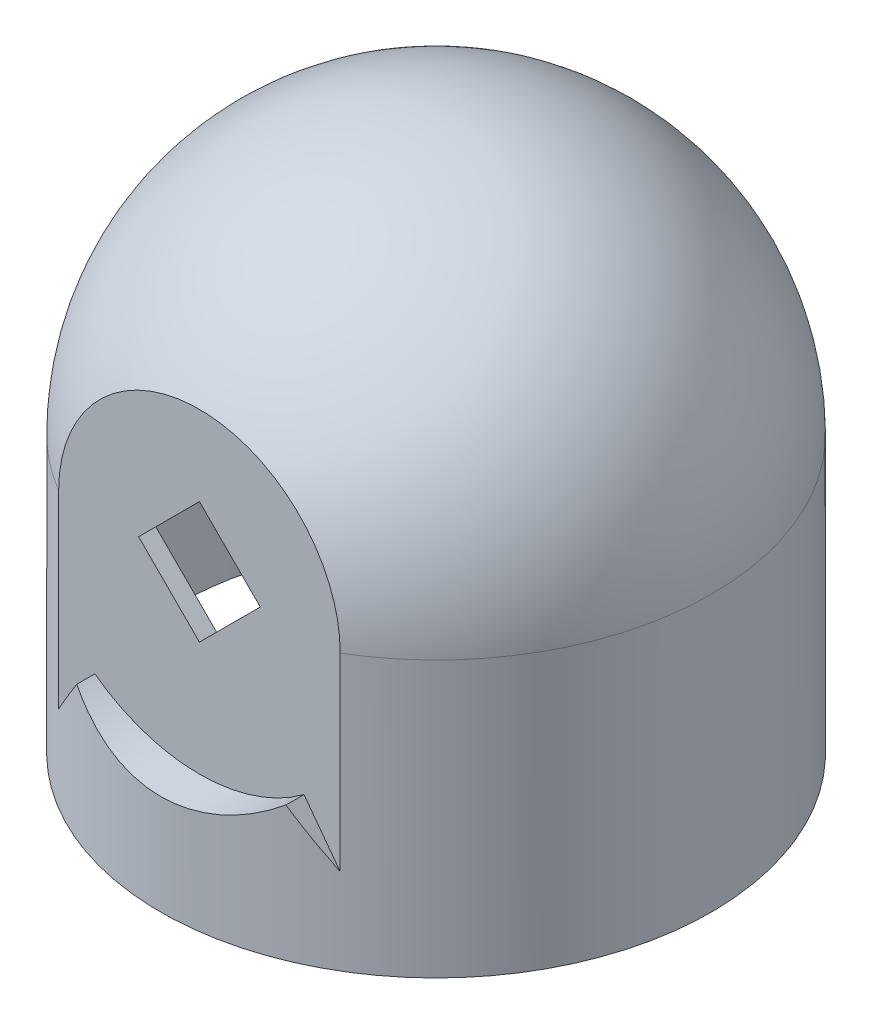
ISO-10303-21;
HEADER;
FILE_DESCRIPTION(('STEP AP214'),'2;1');
FILE_NAME('part.step','',(''),(''),'','','');
FILE_SCHEMA(('AUTOMOTIVE_DESIGN { 1 0 10303 214 1 1 1 1 }'));
ENDSEC;
DATA;
#1=APPLICATION_CONTEXT('core data for automotive mechanical design processes');
#2=APPLICATION_PROTOCOL_DEFINITION('international standard','automotive_design',2000,#1);
#3=PRODUCT_CONTEXT('',#1,'mechanical');
#4=PRODUCT('Part','Part','',(#3));
#5=PRODUCT_RELATED_PRODUCT_CATEGORY('part','',(#4));
#6=PRODUCT_DEFINITION_FORMATION('','',#4);
#7=PRODUCT_DEFINITION_CONTEXT('part definition',#1,'design');
#8=PRODUCT_DEFINITION('design','',#6,#7);
#9=PRODUCT_DEFINITION_SHAPE('','',#8);
#10=(LENGTH_UNIT() NAMED_UNIT(*) SI_UNIT(.MILLI.,.METRE.));
#11=(NAMED_UNIT(*) PLANE_ANGLE_UNIT() SI_UNIT($,.RADIAN.));
#12=(NAMED_UNIT(*) SI_UNIT($,.STERADIAN.) SOLID_ANGLE_UNIT());
#13=UNCERTAINTY_MEASURE_WITH_UNIT(LENGTH_MEASURE(1.E-05),#10,'distance_accuracy_value','');
#14=(GEOMETRIC_REPRESENTATION_CONTEXT(3) GLOBAL_UNCERTAINTY_ASSIGNED_CONTEXT((#13)) GLOBAL_UNIT_ASSIGNED_CONTEXT((#10,
#11,#12)) REPRESENTATION_CONTEXT('',''));
#15=CARTESIAN_POINT('',(0.,0.,0.));
#16=DIRECTION('',(0.,0.,1.));
#17=DIRECTION('',(1.,0.,0.));
#18=AXIS2_PLACEMENT_3D('',#15,#16,#17);
#19=CARTESIAN_POINT('',(0.,16.,13.75));
#20=DIRECTION('',(0.,0.,1.));
#21=DIRECTION('',(1.,0.,0.));
#22=AXIS2_PLACEMENT_3D('',#19,#20,#21);
#23=PLANE('',#22);
#24=DIRECTION('',(-0.707106781186547,-0.707106781186548,0.));
#25=VECTOR('',#24,1.);
#26=CARTESIAN_POINT('',(-3.53553390593274,16.,13.75));
#27=LINE('',#26,#25);
#28=CARTESIAN_POINT('',(0.,19.5355339059327,13.75));
#29=VERTEX_POINT('',#28);
#30=CARTESIAN_POINT('',(-3.53553390593274,16.,13.75));
#31=VERTEX_POINT('',#30);
#32=EDGE_CURVE('E55',#29,#31,#27,.T.);
#33=ORIENTED_EDGE('',*,*,#32,.F.);
#34=DIRECTION('',(-0.707106781186548,0.707106781186547,0.));
#35=VECTOR('',#34,1.);
#36=CARTESIAN_POINT('',(0.,19.5355339059327,13.75));
#37=LINE('',#36,#35);
#38=CARTESIAN_POINT('',(3.53553390593274,16.,13.75));
#39=VERTEX_POINT('',#38);
#40=EDGE_CURVE('E545',#39,#29,#37,.T.);
#41=ORIENTED_EDGE('',*,*,#40,.F.);
#42=DIRECTION('',(0.707106781186547,0.707106781186548,0.));
#43=VECTOR('',#42,1.);
#44=CARTESIAN_POINT('',(0.,12.4644660940673,13.75));
#45=LINE('',#44,#43);
#46=CARTESIAN_POINT('',(0.,12.4644660940673,13.75));
#47=VERTEX_POINT('',#46);
#48=EDGE_CURVE('E542',#47,#39,#45,.T.);
#49=ORIENTED_EDGE('',*,*,#48,.F.);
#50=DIRECTION('',(0.707106781186547,-0.707106781186548,0.));
#51=VECTOR('',#50,1.);
#52=CARTESIAN_POINT('',(-3.53553390593274,16.,13.75));
#53=LINE('',#52,#51);
#54=EDGE_CURVE('E539',#31,#47,#53,.T.);
#55=ORIENTED_EDGE('',*,*,#54,.F.);
#56=EDGE_LOOP('',(#33,#41,#49,#55));
#57=FACE_BOUND('',#56,.T.);
#58=CARTESIAN_POINT('',(0.,16.,13.75));
#59=DIRECTION('',(0.,0.,-1.));
#60=DIRECTION('',(1.,0.,0.));
#61=AXIS2_PLACEMENT_3D('',#58,#59,#60);
#62=CIRCLE('',#61,10.1815340859768);
#63=CARTESIAN_POINT('',(6.07632844604467,7.83043030755625,13.75));
#64=VERTEX_POINT('',#63);
#65=CARTESIAN_POINT('',(-6.07632844604468,7.83043030755625,13.75));
#66=VERTEX_POINT('',#65);
#67=EDGE_CURVE('E562',#64,#66,#62,.T.);
#68=ORIENTED_EDGE('',*,*,#67,.F.);
#69=DIRECTION('',(-0.596798910138082,0.802390840462426,0.));
#70=VECTOR('',#69,1.);
#71=CARTESIAN_POINT('',(6.07632844604467,7.83043030755625,13.75));
#72=LINE('',#71,#70);
#73=CARTESIAN_POINT('',(8.18153408597679,5.,13.75));
#74=VERTEX_POINT('',#73);
#75=EDGE_CURVE('E294',#74,#64,#72,.T.);
#76=ORIENTED_EDGE('',*,*,#75,.F.);
#77=DIRECTION('',(0.,1.,0.));
#78=VECTOR('',#77,1.);
#79=CARTESIAN_POINT('',(8.18153408597679,5.,13.75));
#80=LINE('',#79,#78);
#81=CARTESIAN_POINT('',(8.18153408597679,16.,13.75));
#82=VERTEX_POINT('',#81);
#83=EDGE_CURVE('E329',#74,#82,#80,.T.);
#84=ORIENTED_EDGE('',*,*,#83,.T.);
#85=CARTESIAN_POINT('',(0.,16.,13.75));
#86=DIRECTION('',(0.,0.,1.));
#87=DIRECTION('',(1.,0.,0.));
#88=AXIS2_PLACEMENT_3D('',#85,#86,#87);
#89=CIRCLE('',#88,8.18153408597679);
#90=CARTESIAN_POINT('',(-8.18153408597679,16.,13.75));
#91=VERTEX_POINT('',#90);
#92=EDGE_CURVE('E351',#82,#91,#89,.T.);
#93=ORIENTED_EDGE('',*,*,#92,.T.);
#94=DIRECTION('',(0.,-1.,0.));
#95=VECTOR('',#94,1.);
#96=CARTESIAN_POINT('',(-8.18153408597679,16.,13.75));
#97=LINE('',#96,#95);
#98=CARTESIAN_POINT('',(-8.18153408597679,5.,13.75));
#99=VERTEX_POINT('',#98);
#100=EDGE_CURVE('E353',#91,#99,#97,.T.);
#101=ORIENTED_EDGE('',*,*,#100,.T.);
#102=DIRECTION('',(-0.596798910138081,-0.802390840462426,0.));
#103=VECTOR('',#102,1.);
#104=CARTESIAN_POINT('',(-8.18153408597678,5.,13.75));
#105=LINE('',#104,#103);
#106=EDGE_CURVE('E559',#66,#99,#105,.T.);
#107=ORIENTED_EDGE('',*,*,#106,.F.);
#108=EDGE_LOOP('',(#68,#76,#84,#93,#101,#107));
#109=FACE_BOUND('',#108,.T.);
#110=ADVANCED_FACE('F40',(#57,#109),#23,.T.);
#111=CARTESIAN_POINT('',(0.,0.,0.));
#112=DIRECTION('',(0.,-1.,0.));
#113=DIRECTION('',(0.,0.,-1.));
#114=AXIS2_PLACEMENT_3D('',#111,#112,#113);
#115=CYLINDRICAL_SURFACE('',#114,16.);
#116=CARTESIAN_POINT('',(0.,16.,0.));
#117=DIRECTION('',(0.,-1.,0.));
#118=DIRECTION('',(0.,0.,-1.));
#119=AXIS2_PLACEMENT_3D('',#116,#117,#118);
#120=CIRCLE('',#119,16.);
#121=CARTESIAN_POINT('',(-8.18153408597698,16.,-13.7499999999999));
#122=VERTEX_POINT('',#121);
#123=EDGE_CURVE('E356',#91,#122,#120,.T.);
#124=ORIENTED_EDGE('',*,*,#123,.T.);
#125=DIRECTION('',(0.,-1.,0.));
#126=VECTOR('',#125,1.);
#127=CARTESIAN_POINT('',(-8.18153408597698,16.,-13.7499999999999));
#128=LINE('',#127,#126);
#129=CARTESIAN_POINT('',(-8.18153408597698,5.,-13.7499999999999));
#130=VERTEX_POINT('',#129);
#131=EDGE_CURVE('E500',#122,#130,#128,.T.);
#132=ORIENTED_EDGE('',*,*,#131,.T.);
#133=CARTESIAN_POINT('',(0.,16.,0.));
#134=DIRECTION('',(-0.802390840462426,0.596798910138081,0.));
#135=DIRECTION('',(-0.596798910138081,-0.802390840462426,0.));
#136=AXIS2_PLACEMENT_3D('',#133,#134,#135);
#137=ELLIPSE('',#136,26.809700433766,16.);
#138=CARTESIAN_POINT('',(-6.07632844604488,7.83043030755625,-14.8012915860673));
#139=VERTEX_POINT('',#138);
#140=EDGE_CURVE('E217',#139,#130,#137,.T.);
#141=ORIENTED_EDGE('',*,*,#140,.F.);
#142=CARTESIAN_POINT('',(6.07632844604447,7.83043030755626,-14.8012915860674));
#143=CARTESIAN_POINT('',(5.86995259585982,7.67692601325899,-14.8860376151219));
#144=CARTESIAN_POINT('',(5.65706106201564,7.53073686975082,-14.9683686621507));
#145=CARTESIAN_POINT('',(5.21892586714013,7.25393700193324,-15.1266958517996));
#146=CARTESIAN_POINT('',(4.99367371198637,7.12333719124245,-15.2026875453529));
#147=CARTESIAN_POINT('',(4.53069446913676,6.87830295098523,-15.3470491537934));
#148=CARTESIAN_POINT('',(4.29291344711905,6.76394785079169,-15.4153813437683));
#149=CARTESIAN_POINT('',(3.80705919278931,6.55330640304091,-15.5425004191189));
#150=CARTESIAN_POINT('',(3.55898815305502,6.45701623014768,-15.6012893249751));
#151=CARTESIAN_POINT('',(3.05274936920001,6.28319473222906,-15.7082128796894));
#152=CARTESIAN_POINT('',(2.7945397635341,6.20575341463358,-15.7562963180054));
#153=CARTESIAN_POINT('',(2.27088218425739,6.07126390359433,-15.8402462221136));
#154=CARTESIAN_POINT('',(2.0054337691899,6.01421695690221,-15.8761119410041));
#155=CARTESIAN_POINT('',(1.47011819558042,5.92150920956127,-15.934586559467));
#156=CARTESIAN_POINT('',(1.20026478913334,5.88579149184611,-15.9572307371063));
#157=CARTESIAN_POINT('',(0.657777966958707,5.83608673871787,-15.9887811755158));
#158=CARTESIAN_POINT('',(0.385144844841877,5.82209743166758,-15.9976888723913));
#159=CARTESIAN_POINT('',(-0.136852203266903,5.81633464089426,-16.0013564473057));
#160=CARTESIAN_POINT('',(-0.386190398963313,5.82274531506692,-15.9972727264253));
#161=CARTESIAN_POINT('',(-0.883257844821782,5.85379418892486,-15.9775376898596));
#162=CARTESIAN_POINT('',(-1.13098717709601,5.87843145087975,-15.9618869692789));
#163=CARTESIAN_POINT('',(-1.62325701585299,5.94562534013583,-15.9193636179962));
#164=CARTESIAN_POINT('',(-1.86779428594466,5.98819888765229,-15.8924803912949));
#165=CARTESIAN_POINT('',(-2.35176419885099,6.09070998838921,-15.8281016682059));
#166=CARTESIAN_POINT('',(-2.59119687243855,6.15064743690018,-15.7906062358131));
#167=CARTESIAN_POINT('',(-3.06001870768064,6.28616467121049,-15.7064376641242));
#168=CARTESIAN_POINT('',(-3.28950352979188,6.36150294499402,-15.6599067231009));
#169=CARTESIAN_POINT('',(-3.74096894530114,6.52758388565384,-15.5582363477339));
#170=CARTESIAN_POINT('',(-3.96294620469317,6.61833329142881,-15.5030931483181));
#171=CARTESIAN_POINT('',(-4.39801988775269,6.81425462552284,-15.3853229014485));
#172=CARTESIAN_POINT('',(-4.61112669271303,6.91940903906822,-15.3227049541108));
#173=CARTESIAN_POINT('',(-5.02794832873224,7.14340115574802,-15.1910334719145));
#174=CARTESIAN_POINT('',(-5.23166346415107,7.2622384150193,-15.1219801458296));
#175=CARTESIAN_POINT('',(-5.54128473513894,7.45745860927633,-15.0102661032211));
#176=CARTESIAN_POINT('',(-5.65066556167075,7.52942158214264,-14.9694128137747));
#177=CARTESIAN_POINT('',(-5.86601722920335,7.67711055239043,-14.8863406942796));
#178=CARTESIAN_POINT('',(-5.97199366678255,7.75282979169904,-14.8441243611547));
#179=CARTESIAN_POINT('',(-6.07632844604488,7.83043030755625,-14.8012915860673));
#180=B_SPLINE_CURVE_WITH_KNOTS('',3,(#142,#143,#144,#145,#146,#147,#148,#149,#150,#151,#152,
#153,#154,#155,#156,#157,#158,#159,#160,#161,#162,#163,#164,#165,#166,#167,#168,#169,#170,#171,
#172,#173,#174,#175,#176,#177,#178,#179),.UNSPECIFIED.,.F.,.F.,(4,2,2,2,2,2,2,2,2,2,2,2,2,2,2,2,
2,2,4),(0.,0.812329233181998,1.62522385896235,2.44196091734298,3.25852483199941,
4.07891471129315,4.89935473420777,5.71759551359047,6.53575074270533,7.28318328367996,
8.03057737305464,8.77867810180929,9.52677431938857,10.2639329509243,11.0014147572432,
11.7380077033754,12.474576761612,12.885956235577,13.2966206744325),.UNSPECIFIED.);
#181=CARTESIAN_POINT('',(6.07632844604446,7.83043030755625,-14.8012915860674));
#182=VERTEX_POINT('',#181);
#183=EDGE_CURVE('E222',#182,#139,#180,.T.);
#184=ORIENTED_EDGE('',*,*,#183,.F.);
#185=CARTESIAN_POINT('',(0.,16.,0.));
#186=DIRECTION('',(0.802390840462426,0.596798910138082,0.));
#187=DIRECTION('',(0.596798910138082,-0.802390840462426,0.));
#188=AXIS2_PLACEMENT_3D('',#185,#186,#187);
#189=ELLIPSE('',#188,26.809700433766,16.);
#190=CARTESIAN_POINT('',(8.18153408597659,5.,-13.7500000000001));
#191=VERTEX_POINT('',#190);
#192=EDGE_CURVE('E232',#191,#182,#189,.T.);
#193=ORIENTED_EDGE('',*,*,#192,.F.);
#194=DIRECTION('',(0.,1.,0.));
#195=VECTOR('',#194,1.);
#196=CARTESIAN_POINT('',(8.18153408597659,5.,-13.7500000000001));
#197=LINE('',#196,#195);
#198=CARTESIAN_POINT('',(8.18153408597659,16.,-13.7500000000001));
#199=VERTEX_POINT('',#198);
#200=EDGE_CURVE('E517',#191,#199,#197,.T.);
#201=ORIENTED_EDGE('',*,*,#200,.T.);
#202=EDGE_CURVE('E357',#199,#82,#120,.T.);
#203=ORIENTED_EDGE('',*,*,#202,.T.);
#204=ORIENTED_EDGE('',*,*,#83,.F.);
#205=CARTESIAN_POINT('',(0.,16.,0.));
#206=DIRECTION('',(-0.802390840462426,-0.596798910138082,0.));
#207=DIRECTION('',(0.596798910138082,-0.802390840462426,0.));
#208=AXIS2_PLACEMENT_3D('',#205,#206,#207);
#209=ELLIPSE('',#208,26.809700433766,16.);
#210=CARTESIAN_POINT('',(6.07632844604467,7.83043030755625,14.8012915860674));
#211=VERTEX_POINT('',#210);
#212=EDGE_CURVE('E293',#74,#211,#209,.T.);
#213=ORIENTED_EDGE('',*,*,#212,.T.);
#214=CARTESIAN_POINT('',(6.07632844604467,7.83043030755626,14.8012915860674));
#215=CARTESIAN_POINT('',(5.86995259586003,7.67692601325899,14.8860376151218));
#216=CARTESIAN_POINT('',(5.65706106201585,7.53073686975082,14.9683686621506));
#217=CARTESIAN_POINT('',(5.21892586714034,7.25393700193324,15.1266958517995));
#218=CARTESIAN_POINT('',(4.99367371198658,7.12333719124245,15.2026875453529));
#219=CARTESIAN_POINT('',(4.53069446913697,6.87830295098523,15.3470491537933));
#220=CARTESIAN_POINT('',(4.29291344711926,6.76394785079169,15.4153813437682));
#221=CARTESIAN_POINT('',(3.80705919278953,6.55330640304091,15.5425004191188));
#222=CARTESIAN_POINT('',(3.55898815305524,6.45701623014768,15.6012893249751));
#223=CARTESIAN_POINT('',(3.05274936920023,6.28319473222906,15.7082128796894));
#224=CARTESIAN_POINT('',(2.79453976353432,6.20575341463358,15.7562963180054));
#225=CARTESIAN_POINT('',(2.27088218425761,6.07126390359433,15.8402462221136));
#226=CARTESIAN_POINT('',(2.00543376919012,6.01421695690221,15.8761119410041));
#227=CARTESIAN_POINT('',(1.47011819558064,5.92150920956127,15.934586559467));
#228=CARTESIAN_POINT('',(1.20026478913357,5.88579149184611,15.9572307371063));
#229=CARTESIAN_POINT('',(0.65777796695893,5.83608673871787,15.9887811755158));
#230=CARTESIAN_POINT('',(0.3851448448421,5.82209743166758,15.9976888723913));
#231=CARTESIAN_POINT('',(-0.13685220326668,5.81633464089426,16.0013564473057));
#232=CARTESIAN_POINT('',(-0.386190398963089,5.82274531506692,15.9972727264253));
#233=CARTESIAN_POINT('',(-0.883257844821559,5.85379418892486,15.9775376898596));
#234=CARTESIAN_POINT('',(-1.13098717709578,5.87843145087975,15.9618869692789));
#235=CARTESIAN_POINT('',(-1.62325701585277,5.94562534013583,15.9193636179962));
#236=CARTESIAN_POINT('',(-1.86779428594443,5.98819888765229,15.8924803912949));
#237=CARTESIAN_POINT('',(-2.35176419885077,6.09070998838921,15.8281016682059));
#238=CARTESIAN_POINT('',(-2.59119687243833,6.15064743690018,15.7906062358131));
#239=CARTESIAN_POINT('',(-3.06001870768042,6.28616467121049,15.7064376641242));
#240=CARTESIAN_POINT('',(-3.28950352979166,6.36150294499402,15.659906723101));
#241=CARTESIAN_POINT('',(-3.74096894530092,6.52758388565384,15.5582363477339));
#242=CARTESIAN_POINT('',(-3.96294620469295,6.61833329142881,15.5030931483181));
#243=CARTESIAN_POINT('',(-4.39801988775247,6.81425462552284,15.3853229014485));
#244=CARTESIAN_POINT('',(-4.61112669271282,6.91940903906822,15.3227049541108));
#245=CARTESIAN_POINT('',(-5.02794832873203,7.14340115574802,15.1910334719146));
#246=CARTESIAN_POINT('',(-5.23166346415086,7.2622384150193,15.1219801458297));
#247=CARTESIAN_POINT('',(-5.54128473513873,7.45745860927633,15.0102661032212));
#248=CARTESIAN_POINT('',(-5.65066556167054,7.52942158214264,14.9694128137748));
#249=CARTESIAN_POINT('',(-5.86601722920314,7.67711055239043,14.8863406942797));
#250=CARTESIAN_POINT('',(-5.97199366678234,7.75282979169904,14.8441243611548));
#251=CARTESIAN_POINT('',(-6.07632844604467,7.83043030755625,14.8012915860674));
#252=B_SPLINE_CURVE_WITH_KNOTS('',3,(#214,#215,#216,#217,#218,#219,#220,#221,#222,#223,#224,
#225,#226,#227,#228,#229,#230,#231,#232,#233,#234,#235,#236,#237,#238,#239,#240,#241,#242,#243,
#244,#245,#246,#247,#248,#249,#250,#251),.UNSPECIFIED.,.F.,.F.,(4,2,2,2,2,2,2,2,2,2,2,2,2,2,2,2,
2,2,4),(0.,0.812329233181999,1.62522385896235,2.44196091734298,3.25852483199941,
4.07891471129315,4.89935473420777,5.71759551359047,6.53575074270533,7.28318328367996,
8.03057737305464,8.77867810180929,9.52677431938857,10.2639329509243,11.0014147572432,
11.7380077033754,12.474576761612,12.885956235577,13.2966206744325),.UNSPECIFIED.);
#253=CARTESIAN_POINT('',(-6.07632844604467,7.83043030755625,14.8012915860674));
#254=VERTEX_POINT('',#253);
#255=EDGE_CURVE('E283',#211,#254,#252,.T.);
#256=ORIENTED_EDGE('',*,*,#255,.T.);
#257=CARTESIAN_POINT('',(0.,16.,0.));
#258=DIRECTION('',(0.802390840462426,-0.596798910138081,0.));
#259=DIRECTION('',(-0.596798910138081,-0.802390840462426,0.));
#260=AXIS2_PLACEMENT_3D('',#257,#258,#259);
#261=ELLIPSE('',#260,26.809700433766,16.);
#262=EDGE_CURVE('E560',#254,#99,#261,.T.);
#263=ORIENTED_EDGE('',*,*,#262,.T.);
#264=ORIENTED_EDGE('',*,*,#100,.F.);
#265=EDGE_LOOP('',(#124,#132,#141,#184,#193,#201,#203,#204,#213,#256,#263,#264));
#266=FACE_BOUND('',#265,.T.);
#267=CARTESIAN_POINT('',(0.,0.,0.));
#268=DIRECTION('',(0.,-1.,0.));
#269=DIRECTION('',(0.,0.,-1.));
#270=AXIS2_PLACEMENT_3D('',#267,#268,#269);
#271=CIRCLE('',#270,16.);
#272=CARTESIAN_POINT('',(0.,0.,-16.));
#273=VERTEX_POINT('',#272);
#274=EDGE_CURVE('E48',#273,#273,#271,.T.);
#275=ORIENTED_EDGE('',*,*,#274,.F.);
#276=EDGE_LOOP('',(#275));
#277=FACE_BOUND('',#276,.T.);
#278=ADVANCED_FACE('F266',(#266,#277),#115,.T.);
#279=CARTESIAN_POINT('',(0.,16.,0.));
#280=DIRECTION('',(0.,-1.,0.));
#281=DIRECTION('',(1.,0.,0.));
#282=AXIS2_PLACEMENT_3D('',#279,#280,#281);
#283=SPHERICAL_SURFACE('',#282,16.);
#284=ORIENTED_EDGE('',*,*,#123,.F.);
#285=ORIENTED_EDGE('',*,*,#92,.F.);
#286=ORIENTED_EDGE('',*,*,#202,.F.);
#287=CARTESIAN_POINT('',(-1.92031473636372E-13,16.,-13.75));
#288=DIRECTION('',(0.,0.,1.));
#289=DIRECTION('',(1.,0.,0.));
#290=AXIS2_PLACEMENT_3D('',#287,#288,#289);
#291=CIRCLE('',#290,8.18153408597679);
#292=EDGE_CURVE('E505',#199,#122,#291,.T.);
#293=ORIENTED_EDGE('',*,*,#292,.T.);
#294=EDGE_LOOP('',(#284,#285,#286,#293));
#295=FACE_BOUND('',#294,.T.);
#296=ADVANCED_FACE('F272',(#295),#283,.T.);
#297=CARTESIAN_POINT('',(0.,0.,0.));
#298=DIRECTION('',(0.,-1.,0.));
#299=DIRECTION('',(0.,0.,-1.));
#300=AXIS2_PLACEMENT_3D('',#297,#298,#299);
#301=PLANE('',#300);
#302=CARTESIAN_POINT('',(0.,0.,0.));
#303=DIRECTION('',(0.,-1.,0.));
#304=DIRECTION('',(0.,0.,-1.));
#305=AXIS2_PLACEMENT_3D('',#302,#303,#304);
#306=CIRCLE('',#305,15.);
#307=CARTESIAN_POINT('',(0.,0.,-15.));
#308=VERTEX_POINT('',#307);
#309=EDGE_CURVE('E330',#308,#308,#306,.T.);
#310=ORIENTED_EDGE('',*,*,#309,.F.);
#311=EDGE_LOOP('',(#310));
#312=FACE_BOUND('',#311,.T.);
#313=ORIENTED_EDGE('',*,*,#274,.T.);
#314=EDGE_LOOP('',(#313));
#315=FACE_BOUND('',#314,.T.);
#316=ADVANCED_FACE('F42',(#312,#315),#301,.T.);
#317=CARTESIAN_POINT('',(0.,0.,0.));
#318=DIRECTION('',(0.,-1.,0.));
#319=DIRECTION('',(0.,0.,-1.));
#320=AXIS2_PLACEMENT_3D('',#317,#318,#319);
#321=CYLINDRICAL_SURFACE('',#320,15.);
#322=DIRECTION('',(0.,-1.,0.));
#323=VECTOR('',#322,1.);
#324=CARTESIAN_POINT('',(-7.90174031463973,16.,-12.7499999999999));
#325=LINE('',#324,#323);
#326=CARTESIAN_POINT('',(-7.90174031463973,16.,-12.7499999999999));
#327=VERTEX_POINT('',#326);
#328=CARTESIAN_POINT('',(-7.90174031463978,4.,-12.7499999999999));
#329=VERTEX_POINT('',#328);
#330=EDGE_CURVE('E518',#327,#329,#325,.T.);
#331=ORIENTED_EDGE('',*,*,#330,.F.);
#332=CARTESIAN_POINT('',(0.,16.,0.));
#333=DIRECTION('',(0.,-1.,0.));
#334=DIRECTION('',(0.,0.,-1.));
#335=AXIS2_PLACEMENT_3D('',#332,#333,#334);
#336=CIRCLE('',#335,15.);
#337=CARTESIAN_POINT('',(-7.90174031463955,16.,12.75));
#338=VERTEX_POINT('',#337);
#339=EDGE_CURVE('E337',#338,#327,#336,.T.);
#340=ORIENTED_EDGE('',*,*,#339,.F.);
#341=DIRECTION('',(0.,-1.,0.));
#342=VECTOR('',#341,1.);
#343=CARTESIAN_POINT('',(-7.90174031463955,16.,12.75));
#344=LINE('',#343,#342);
#345=CARTESIAN_POINT('',(-7.9017403146396,4.,12.75));
#346=VERTEX_POINT('',#345);
#347=EDGE_CURVE('E334',#338,#346,#344,.T.);
#348=ORIENTED_EDGE('',*,*,#347,.T.);
#349=CARTESIAN_POINT('',(0.,4.,0.));
#350=DIRECTION('',(0.,1.,0.));
#351=DIRECTION('',(0.,0.,1.));
#352=AXIS2_PLACEMENT_3D('',#349,#350,#351);
#353=CIRCLE('',#352,15.);
#354=CARTESIAN_POINT('',(7.9017403146396,4.,12.75));
#355=VERTEX_POINT('',#354);
#356=EDGE_CURVE('E325',#355,#346,#353,.F.);
#357=ORIENTED_EDGE('',*,*,#356,.F.);
#358=DIRECTION('',(0.,-1.,0.));
#359=VECTOR('',#358,1.);
#360=CARTESIAN_POINT('',(7.9017403146396,4.,12.75));
#361=LINE('',#360,#359);
#362=CARTESIAN_POINT('',(7.90174031463955,16.,12.75));
#363=VERTEX_POINT('',#362);
#364=EDGE_CURVE('E342',#355,#363,#361,.F.);
#365=ORIENTED_EDGE('',*,*,#364,.T.);
#366=CARTESIAN_POINT('',(0.,16.,0.));
#367=DIRECTION('',(0.,-1.,0.));
#368=DIRECTION('',(0.,0.,-1.));
#369=AXIS2_PLACEMENT_3D('',#366,#367,#368);
#370=CIRCLE('',#369,15.);
#371=CARTESIAN_POINT('',(7.90174031463937,16.,-12.7500000000001));
#372=VERTEX_POINT('',#371);
#373=EDGE_CURVE('E349',#372,#363,#370,.T.);
#374=ORIENTED_EDGE('',*,*,#373,.F.);
#375=DIRECTION('',(0.,-1.,0.));
#376=VECTOR('',#375,1.);
#377=CARTESIAN_POINT('',(7.90174031463942,4.,-12.7500000000001));
#378=LINE('',#377,#376);
#379=CARTESIAN_POINT('',(7.90174031463942,4.,-12.7500000000001));
#380=VERTEX_POINT('',#379);
#381=EDGE_CURVE('E522',#380,#372,#378,.F.);
#382=ORIENTED_EDGE('',*,*,#381,.F.);
#383=CARTESIAN_POINT('',(0.,4.,0.));
#384=DIRECTION('',(0.,-1.,0.));
#385=DIRECTION('',(0.,0.,-1.));
#386=AXIS2_PLACEMENT_3D('',#383,#384,#385);
#387=CIRCLE('',#386,15.);
#388=EDGE_CURVE('E514',#380,#329,#387,.F.);
#389=ORIENTED_EDGE('',*,*,#388,.T.);
#390=EDGE_LOOP('',(#331,#340,#348,#357,#365,#374,#382,#389));
#391=FACE_BOUND('',#390,.T.);
#392=ORIENTED_EDGE('',*,*,#309,.T.);
#393=EDGE_LOOP('',(#392));
#394=FACE_BOUND('',#393,.T.);
#395=ADVANCED_FACE('F309',(#391,#394),#321,.F.);
#396=CARTESIAN_POINT('',(0.,16.,0.));
#397=DIRECTION('',(0.,-1.,0.));
#398=DIRECTION('',(1.,0.,0.));
#399=AXIS2_PLACEMENT_3D('',#396,#397,#398);
#400=SPHERICAL_SURFACE('',#399,15.);
#401=CARTESIAN_POINT('',(0.,29.9552857369529,0.));
#402=DIRECTION('',(0.,-1.,0.));
#403=DIRECTION('',(0.,0.,-1.));
#404=AXIS2_PLACEMENT_3D('',#401,#402,#403);
#405=CIRCLE('',#404,5.5);
#406=CARTESIAN_POINT('',(0.,29.9552857369529,-5.5));
#407=VERTEX_POINT('',#406);
#408=EDGE_CURVE('E703',#407,#407,#405,.T.);
#409=ORIENTED_EDGE('',*,*,#408,.F.);
#410=EDGE_LOOP('',(#409));
#411=FACE_BOUND('',#410,.T.);
#412=ORIENTED_EDGE('',*,*,#339,.T.);
#413=CARTESIAN_POINT('',(-1.78065548281E-13,16.,-12.75));
#414=DIRECTION('',(0.,0.,1.));
#415=DIRECTION('',(1.,0.,0.));
#416=AXIS2_PLACEMENT_3D('',#413,#414,#415);
#417=CIRCLE('',#416,7.90174031463955);
#418=EDGE_CURVE('E521',#372,#327,#417,.T.);
#419=ORIENTED_EDGE('',*,*,#418,.F.);
#420=ORIENTED_EDGE('',*,*,#373,.T.);
#421=CARTESIAN_POINT('',(0.,16.,12.75));
#422=DIRECTION('',(0.,0.,1.));
#423=DIRECTION('',(1.,0.,0.));
#424=AXIS2_PLACEMENT_3D('',#421,#422,#423);
#425=CIRCLE('',#424,7.90174031463955);
#426=EDGE_CURVE('E340',#363,#338,#425,.T.);
#427=ORIENTED_EDGE('',*,*,#426,.T.);
#428=EDGE_LOOP('',(#412,#419,#420,#427));
#429=FACE_BOUND('',#428,.T.);
#430=ADVANCED_FACE('F312',(#411,#429),#400,.F.);
#431=CARTESIAN_POINT('',(-8.18153408597678,4.,16.));
#432=DIRECTION('',(0.,1.,0.));
#433=DIRECTION('',(0.,0.,1.));
#434=AXIS2_PLACEMENT_3D('',#431,#432,#433);
#435=PLANE('',#434);
#436=ORIENTED_EDGE('',*,*,#356,.T.);
#437=DIRECTION('',(1.,0.,0.));
#438=VECTOR('',#437,1.);
#439=CARTESIAN_POINT('',(-8.18153408597678,4.,12.75));
#440=LINE('',#439,#438);
#441=EDGE_CURVE('E292',#346,#355,#440,.T.);
#442=ORIENTED_EDGE('',*,*,#441,.T.);
#443=EDGE_LOOP('',(#436,#442));
#444=FACE_BOUND('',#443,.T.);
#445=ADVANCED_FACE('F315',(#444),#435,.F.);
#446=CARTESIAN_POINT('',(0.,16.,12.75));
#447=DIRECTION('',(0.,0.,1.));
#448=DIRECTION('',(1.,0.,0.));
#449=AXIS2_PLACEMENT_3D('',#446,#447,#448);
#450=PLANE('',#449);
#451=DIRECTION('',(0.707106781186548,-0.707106781186547,0.));
#452=VECTOR('',#451,1.);
#453=CARTESIAN_POINT('',(0.,19.5355339059327,12.75));
#454=LINE('',#453,#452);
#455=CARTESIAN_POINT('',(0.,19.5355339059327,12.75));
#456=VERTEX_POINT('',#455);
#457=CARTESIAN_POINT('',(3.53553390593274,16.,12.75));
#458=VERTEX_POINT('',#457);
#459=EDGE_CURVE('E532',#456,#458,#454,.T.);
#460=ORIENTED_EDGE('',*,*,#459,.F.);
#461=DIRECTION('',(0.707106781186547,0.707106781186548,0.));
#462=VECTOR('',#461,1.);
#463=CARTESIAN_POINT('',(-3.53553390593274,16.,12.75));
#464=LINE('',#463,#462);
#465=CARTESIAN_POINT('',(-3.53553390593274,16.,12.75));
#466=VERTEX_POINT('',#465);
#467=EDGE_CURVE('E535',#466,#456,#464,.T.);
#468=ORIENTED_EDGE('',*,*,#467,.F.);
#469=DIRECTION('',(-0.707106781186547,0.707106781186548,0.));
#470=VECTOR('',#469,1.);
#471=CARTESIAN_POINT('',(-3.53553390593274,16.,12.75));
#472=LINE('',#471,#470);
#473=CARTESIAN_POINT('',(0.,12.4644660940673,12.75));
#474=VERTEX_POINT('',#473);
#475=EDGE_CURVE('E551',#474,#466,#472,.T.);
#476=ORIENTED_EDGE('',*,*,#475,.F.);
#477=DIRECTION('',(-0.707106781186547,-0.707106781186548,0.));
#478=VECTOR('',#477,1.);
#479=CARTESIAN_POINT('',(0.,12.4644660940673,12.75));
#480=LINE('',#479,#478);
#481=EDGE_CURVE('E63',#458,#474,#480,.T.);
#482=ORIENTED_EDGE('',*,*,#481,.F.);
#483=EDGE_LOOP('',(#460,#468,#476,#482));
#484=FACE_BOUND('',#483,.T.);
#485=ORIENTED_EDGE('',*,*,#441,.F.);
#486=ORIENTED_EDGE('',*,*,#347,.F.);
#487=ORIENTED_EDGE('',*,*,#426,.F.);
#488=ORIENTED_EDGE('',*,*,#364,.F.);
#489=EDGE_LOOP('',(#485,#486,#487,#488));
#490=FACE_BOUND('',#489,.T.);
#491=ADVANCED_FACE('F277',(#484,#490),#450,.F.);
#492=CARTESIAN_POINT('',(6.07632844604467,7.83043030755625,16.001));
#493=DIRECTION('',(-0.802390840462426,-0.596798910138082,0.));
#494=DIRECTION('',(0.596798910138082,-0.802390840462426,0.));
#495=AXIS2_PLACEMENT_3D('',#492,#493,#494);
#496=PLANE('',#495);
#497=ORIENTED_EDGE('',*,*,#212,.F.);
#498=ORIENTED_EDGE('',*,*,#75,.T.);
#499=DIRECTION('',(0.,0.,-1.));
#500=VECTOR('',#499,1.);
#501=CARTESIAN_POINT('',(6.07632844604467,7.83043030755625,16.001));
#502=LINE('',#501,#500);
#503=EDGE_CURVE('E563',#211,#64,#502,.T.);
#504=ORIENTED_EDGE('',*,*,#503,.F.);
#505=EDGE_LOOP('',(#497,#498,#504));
#506=FACE_BOUND('',#505,.T.);
#507=ADVANCED_FACE('F303',(#506),#496,.F.);
#508=CARTESIAN_POINT('',(0.,16.,16.001));
#509=DIRECTION('',(0.,0.,-1.));
#510=DIRECTION('',(-1.,0.,0.));
#511=AXIS2_PLACEMENT_3D('',#508,#509,#510);
#512=CYLINDRICAL_SURFACE('',#511,10.1815340859768);
#513=ORIENTED_EDGE('',*,*,#255,.F.);
#514=ORIENTED_EDGE('',*,*,#503,.T.);
#515=ORIENTED_EDGE('',*,*,#67,.T.);
#516=DIRECTION('',(0.,0.,-1.));
#517=VECTOR('',#516,1.);
#518=CARTESIAN_POINT('',(-6.07632844604467,7.83043030755625,16.001));
#519=LINE('',#518,#517);
#520=EDGE_CURVE('E561',#254,#66,#519,.T.);
#521=ORIENTED_EDGE('',*,*,#520,.F.);
#522=EDGE_LOOP('',(#513,#514,#515,#521));
#523=FACE_BOUND('',#522,.T.);
#524=ADVANCED_FACE('F297',(#523),#512,.F.);
#525=CARTESIAN_POINT('',(-8.18153408597678,5.,16.001));
#526=DIRECTION('',(0.802390840462426,-0.596798910138081,0.));
#527=DIRECTION('',(0.596798910138081,0.802390840462426,0.));
#528=AXIS2_PLACEMENT_3D('',#525,#526,#527);
#529=PLANE('',#528);
#530=ORIENTED_EDGE('',*,*,#262,.F.);
#531=ORIENTED_EDGE('',*,*,#520,.T.);
#532=ORIENTED_EDGE('',*,*,#106,.T.);
#533=EDGE_LOOP('',(#530,#531,#532));
#534=FACE_BOUND('',#533,.T.);
#535=ADVANCED_FACE('F302',(#534),#529,.F.);
#536=CARTESIAN_POINT('',(-3.53553390593274,16.,-0.00100000000011202));
#537=DIRECTION('',(-0.707106781186548,0.707106781186547,0.));
#538=DIRECTION('',(-0.707106781186547,-0.707106781186548,0.));
#539=AXIS2_PLACEMENT_3D('',#536,#537,#538);
#540=PLANE('',#539);
#541=ORIENTED_EDGE('',*,*,#467,.T.);
#542=DIRECTION('',(0.,0.,1.));
#543=VECTOR('',#542,1.);
#544=CARTESIAN_POINT('',(0.,19.5355339059327,-0.00100000000011202));
#545=LINE('',#544,#543);
#546=EDGE_CURVE('E549',#456,#29,#545,.T.);
#547=ORIENTED_EDGE('',*,*,#546,.T.);
#548=ORIENTED_EDGE('',*,*,#32,.T.);
#549=DIRECTION('',(0.,0.,1.));
#550=VECTOR('',#549,1.);
#551=CARTESIAN_POINT('',(-3.53553390593274,16.,-0.00100000000011202));
#552=LINE('',#551,#550);
#553=EDGE_CURVE('E548',#466,#31,#552,.T.);
#554=ORIENTED_EDGE('',*,*,#553,.F.);
#555=EDGE_LOOP('',(#541,#547,#548,#554));
#556=FACE_BOUND('',#555,.T.);
#557=ADVANCED_FACE('F586',(#556),#540,.F.);
#558=CARTESIAN_POINT('',(0.,19.5355339059327,-0.00100000000011202));
#559=DIRECTION('',(0.707106781186547,0.707106781186548,0.));
#560=DIRECTION('',(-0.707106781186548,0.707106781186547,0.));
#561=AXIS2_PLACEMENT_3D('',#558,#559,#560);
#562=PLANE('',#561);
#563=ORIENTED_EDGE('',*,*,#459,.T.);
#564=DIRECTION('',(0.,0.,1.));
#565=VECTOR('',#564,1.);
#566=CARTESIAN_POINT('',(3.53553390593274,16.,-0.00100000000011202));
#567=LINE('',#566,#565);
#568=EDGE_CURVE('E552',#458,#39,#567,.T.);
#569=ORIENTED_EDGE('',*,*,#568,.T.);
#570=ORIENTED_EDGE('',*,*,#40,.T.);
#571=ORIENTED_EDGE('',*,*,#546,.F.);
#572=EDGE_LOOP('',(#563,#569,#570,#571));
#573=FACE_BOUND('',#572,.T.);
#574=ADVANCED_FACE('F590',(#573),#562,.F.);
#575=CARTESIAN_POINT('',(0.,12.4644660940673,-0.00100000000011202));
#576=DIRECTION('',(0.707106781186548,-0.707106781186547,0.));
#577=DIRECTION('',(0.707106781186547,0.707106781186548,0.));
#578=AXIS2_PLACEMENT_3D('',#575,#576,#577);
#579=PLANE('',#578);
#580=ORIENTED_EDGE('',*,*,#481,.T.);
#581=DIRECTION('',(0.,0.,1.));
#582=VECTOR('',#581,1.);
#583=CARTESIAN_POINT('',(0.,12.4644660940673,-0.00100000000011202));
#584=LINE('',#583,#582);
#585=EDGE_CURVE('E554',#474,#47,#584,.T.);
#586=ORIENTED_EDGE('',*,*,#585,.T.);
#587=ORIENTED_EDGE('',*,*,#48,.T.);
#588=ORIENTED_EDGE('',*,*,#568,.F.);
#589=EDGE_LOOP('',(#580,#586,#587,#588));
#590=FACE_BOUND('',#589,.T.);
#591=ADVANCED_FACE('F261',(#590),#579,.F.);
#592=CARTESIAN_POINT('',(-3.53553390593274,16.,-0.00100000000011202));
#593=DIRECTION('',(-0.707106781186548,-0.707106781186547,0.));
#594=DIRECTION('',(0.707106781186547,-0.707106781186548,0.));
#595=AXIS2_PLACEMENT_3D('',#592,#593,#594);
#596=PLANE('',#595);
#597=ORIENTED_EDGE('',*,*,#475,.T.);
#598=ORIENTED_EDGE('',*,*,#553,.T.);
#599=ORIENTED_EDGE('',*,*,#54,.T.);
#600=ORIENTED_EDGE('',*,*,#585,.F.);
#601=EDGE_LOOP('',(#597,#598,#599,#600));
#602=FACE_BOUND('',#601,.T.);
#603=ADVANCED_FACE('F256',(#602),#596,.F.);
#604=CARTESIAN_POINT('',(-1.92031473636372E-13,16.,-13.75));
#605=DIRECTION('',(0.,0.,-1.));
#606=DIRECTION('',(1.,0.,0.));
#607=AXIS2_PLACEMENT_3D('',#604,#605,#606);
#608=PLANE('',#607);
#609=DIRECTION('',(-0.707106781186547,-0.707106781186548,0.));
#610=VECTOR('',#609,1.);
#611=CARTESIAN_POINT('',(-3.53553390593293,16.,-13.75));
#612=LINE('',#611,#610);
#613=CARTESIAN_POINT('',(-1.93407529371213E-13,19.5355339059327,-13.75));
#614=VERTEX_POINT('',#613);
#615=CARTESIAN_POINT('',(-3.53553390593293,16.,-13.75));
#616=VERTEX_POINT('',#615);
#617=EDGE_CURVE('E198',#614,#616,#612,.T.);
#618=ORIENTED_EDGE('',*,*,#617,.T.);
#619=DIRECTION('',(0.707106781186547,-0.707106781186548,0.));
#620=VECTOR('',#619,1.);
#621=CARTESIAN_POINT('',(-3.53553390593293,16.,-13.75));
#622=LINE('',#621,#620);
#623=CARTESIAN_POINT('',(-1.92031473636372E-13,12.4644660940673,-13.75));
#624=VERTEX_POINT('',#623);
#625=EDGE_CURVE('E184',#616,#624,#622,.T.);
#626=ORIENTED_EDGE('',*,*,#625,.T.);
#627=DIRECTION('',(0.707106781186547,0.707106781186548,0.));
#628=VECTOR('',#627,1.);
#629=CARTESIAN_POINT('',(-1.92031473636372E-13,12.4644660940673,-13.75));
#630=LINE('',#629,#628);
#631=CARTESIAN_POINT('',(3.53553390593255,16.,-13.75));
#632=VERTEX_POINT('',#631);
#633=EDGE_CURVE('E698',#624,#632,#630,.T.);
#634=ORIENTED_EDGE('',*,*,#633,.T.);
#635=DIRECTION('',(-0.707106781186548,0.707106781186547,0.));
#636=VECTOR('',#635,1.);
#637=CARTESIAN_POINT('',(-1.93407529371213E-13,19.5355339059327,-13.75));
#638=LINE('',#637,#636);
#639=EDGE_CURVE('E189',#632,#614,#638,.T.);
#640=ORIENTED_EDGE('',*,*,#639,.T.);
#641=EDGE_LOOP('',(#618,#626,#634,#640));
#642=FACE_BOUND('',#641,.T.);
#643=CARTESIAN_POINT('',(-1.92031473636372E-13,16.,-13.75));
#644=DIRECTION('',(0.,0.,-1.));
#645=DIRECTION('',(1.,0.,0.));
#646=AXIS2_PLACEMENT_3D('',#643,#644,#645);
#647=CIRCLE('',#646,10.1815340859768);
#648=CARTESIAN_POINT('',(6.07632844604448,7.83043030755625,-13.7500000000001));
#649=VERTEX_POINT('',#648);
#650=CARTESIAN_POINT('',(-6.07632844604487,7.83043030755625,-13.7499999999999));
#651=VERTEX_POINT('',#650);
#652=EDGE_CURVE('E219',#649,#651,#647,.T.);
#653=ORIENTED_EDGE('',*,*,#652,.T.);
#654=DIRECTION('',(-0.596798910138081,-0.802390840462426,0.));
#655=VECTOR('',#654,1.);
#656=CARTESIAN_POINT('',(-8.18153408597698,5.,-13.7499999999999));
#657=LINE('',#656,#655);
#658=EDGE_CURVE('E214',#651,#130,#657,.T.);
#659=ORIENTED_EDGE('',*,*,#658,.T.);
#660=ORIENTED_EDGE('',*,*,#131,.F.);
#661=ORIENTED_EDGE('',*,*,#292,.F.);
#662=ORIENTED_EDGE('',*,*,#200,.F.);
#663=DIRECTION('',(-0.596798910138082,0.802390840462426,0.));
#664=VECTOR('',#663,1.);
#665=CARTESIAN_POINT('',(6.07632844604448,7.83043030755625,-13.7500000000001));
#666=LINE('',#665,#664);
#667=EDGE_CURVE('E205',#191,#649,#666,.T.);
#668=ORIENTED_EDGE('',*,*,#667,.T.);
#669=EDGE_LOOP('',(#653,#659,#660,#661,#662,#668));
#670=FACE_BOUND('',#669,.T.);
#671=ADVANCED_FACE('F252',(#642,#670),#608,.T.);
#672=CARTESIAN_POINT('',(-8.18153408597701,4.,-15.9999999999999));
#673=DIRECTION('',(0.,1.,0.));
#674=DIRECTION('',(0.,0.,-1.));
#675=AXIS2_PLACEMENT_3D('',#672,#673,#674);
#676=PLANE('',#675);
#677=ORIENTED_EDGE('',*,*,#388,.F.);
#678=DIRECTION('',(1.,0.,0.));
#679=VECTOR('',#678,1.);
#680=CARTESIAN_POINT('',(-8.18153408597696,4.,-12.7499999999999));
#681=LINE('',#680,#679);
#682=EDGE_CURVE('E231',#329,#380,#681,.T.);
#683=ORIENTED_EDGE('',*,*,#682,.F.);
#684=EDGE_LOOP('',(#677,#683));
#685=FACE_BOUND('',#684,.T.);
#686=ADVANCED_FACE('F249',(#685),#676,.F.);
#687=CARTESIAN_POINT('',(-1.78065548281E-13,16.,-12.75));
#688=DIRECTION('',(0.,0.,-1.));
#689=DIRECTION('',(1.,0.,0.));
#690=AXIS2_PLACEMENT_3D('',#687,#688,#689);
#691=PLANE('',#690);
#692=DIRECTION('',(0.707106781186548,-0.707106781186547,0.));
#693=VECTOR('',#692,1.);
#694=CARTESIAN_POINT('',(-1.7944160401584E-13,19.5355339059327,-12.75));
#695=LINE('',#694,#693);
#696=CARTESIAN_POINT('',(-1.7944160401584E-13,19.5355339059327,-12.75));
#697=VERTEX_POINT('',#696);
#698=CARTESIAN_POINT('',(3.53553390593256,16.,-12.75));
#699=VERTEX_POINT('',#698);
#700=EDGE_CURVE('E199',#697,#699,#695,.T.);
#701=ORIENTED_EDGE('',*,*,#700,.T.);
#702=DIRECTION('',(-0.707106781186547,-0.707106781186548,0.));
#703=VECTOR('',#702,1.);
#704=CARTESIAN_POINT('',(-1.78065548281E-13,12.4644660940673,-12.75));
#705=LINE('',#704,#703);
#706=CARTESIAN_POINT('',(-1.78282388715497E-13,12.4644660940673,-12.75));
#707=VERTEX_POINT('',#706);
#708=EDGE_CURVE('E204',#699,#707,#705,.T.);
#709=ORIENTED_EDGE('',*,*,#708,.T.);
#710=DIRECTION('',(-0.707106781186547,0.707106781186548,0.));
#711=VECTOR('',#710,1.);
#712=CARTESIAN_POINT('',(-3.53553390593291,16.,-12.75));
#713=LINE('',#712,#711);
#714=CARTESIAN_POINT('',(-3.53553390593291,16.,-12.75));
#715=VERTEX_POINT('',#714);
#716=EDGE_CURVE('E181',#707,#715,#713,.T.);
#717=ORIENTED_EDGE('',*,*,#716,.T.);
#718=DIRECTION('',(0.707106781186547,0.707106781186548,0.));
#719=VECTOR('',#718,1.);
#720=CARTESIAN_POINT('',(-3.53553390593291,16.,-12.75));
#721=LINE('',#720,#719);
#722=EDGE_CURVE('E192',#715,#697,#721,.T.);
#723=ORIENTED_EDGE('',*,*,#722,.T.);
#724=EDGE_LOOP('',(#701,#709,#717,#723));
#725=FACE_BOUND('',#724,.T.);
#726=ORIENTED_EDGE('',*,*,#682,.T.);
#727=ORIENTED_EDGE('',*,*,#381,.T.);
#728=ORIENTED_EDGE('',*,*,#418,.T.);
#729=ORIENTED_EDGE('',*,*,#330,.T.);
#730=EDGE_LOOP('',(#726,#727,#728,#729));
#731=FACE_BOUND('',#730,.T.);
#732=ADVANCED_FACE('F201',(#725,#731),#691,.F.);
#733=CARTESIAN_POINT('',(6.07632844604445,7.83043030755625,-16.0010000000001));
#734=DIRECTION('',(-0.802390840462426,-0.596798910138082,0.));
#735=DIRECTION('',(0.596798910138082,-0.802390840462426,0.));
#736=AXIS2_PLACEMENT_3D('',#733,#734,#735);
#737=PLANE('',#736);
#738=ORIENTED_EDGE('',*,*,#192,.T.);
#739=DIRECTION('',(0.,0.,1.));
#740=VECTOR('',#739,1.);
#741=CARTESIAN_POINT('',(6.07632844604445,7.83043030755625,-16.0010000000001));
#742=LINE('',#741,#740);
#743=EDGE_CURVE('E208',#182,#649,#742,.T.);
#744=ORIENTED_EDGE('',*,*,#743,.T.);
#745=ORIENTED_EDGE('',*,*,#667,.F.);
#746=EDGE_LOOP('',(#738,#744,#745));
#747=FACE_BOUND('',#746,.T.);
#748=ADVANCED_FACE('F243',(#747),#737,.F.);
#749=CARTESIAN_POINT('',(-2.23468771611316E-13,16.,-16.001));
#750=DIRECTION('',(0.,0.,1.));
#751=DIRECTION('',(-1.,0.,0.));
#752=AXIS2_PLACEMENT_3D('',#749,#750,#751);
#753=CYLINDRICAL_SURFACE('',#752,10.1815340859768);
#754=ORIENTED_EDGE('',*,*,#183,.T.);
#755=DIRECTION('',(0.,0.,1.));
#756=VECTOR('',#755,1.);
#757=CARTESIAN_POINT('',(-6.0763284460449,7.83043030755625,-16.0009999999999));
#758=LINE('',#757,#756);
#759=EDGE_CURVE('E218',#139,#651,#758,.T.);
#760=ORIENTED_EDGE('',*,*,#759,.T.);
#761=ORIENTED_EDGE('',*,*,#652,.F.);
#762=ORIENTED_EDGE('',*,*,#743,.F.);
#763=EDGE_LOOP('',(#754,#760,#761,#762));
#764=FACE_BOUND('',#763,.T.);
#765=ADVANCED_FACE('F237',(#764),#753,.F.);
#766=CARTESIAN_POINT('',(-8.18153408597701,5.,-16.0009999999999));
#767=DIRECTION('',(0.802390840462426,-0.596798910138081,0.));
#768=DIRECTION('',(0.596798910138081,0.802390840462426,0.));
#769=AXIS2_PLACEMENT_3D('',#766,#767,#768);
#770=PLANE('',#769);
#771=ORIENTED_EDGE('',*,*,#140,.T.);
#772=ORIENTED_EDGE('',*,*,#658,.F.);
#773=ORIENTED_EDGE('',*,*,#759,.F.);
#774=EDGE_LOOP('',(#771,#772,#773));
#775=FACE_BOUND('',#774,.T.);
#776=ADVANCED_FACE('F242',(#775),#770,.F.);
#777=CARTESIAN_POINT('',(-3.53553390593274,16.,0.0010000000001614));
#778=DIRECTION('',(-0.707106781186548,0.707106781186547,0.));
#779=DIRECTION('',(-0.707106781186547,-0.707106781186548,0.));
#780=AXIS2_PLACEMENT_3D('',#777,#778,#779);
#781=PLANE('',#780);
#782=ORIENTED_EDGE('',*,*,#722,.F.);
#783=DIRECTION('',(0.,0.,-1.));
#784=VECTOR('',#783,1.);
#785=CARTESIAN_POINT('',(-3.53553390593274,16.,0.0010000000001614));
#786=LINE('',#785,#784);
#787=EDGE_CURVE('E177',#715,#616,#786,.T.);
#788=ORIENTED_EDGE('',*,*,#787,.T.);
#789=ORIENTED_EDGE('',*,*,#617,.F.);
#790=DIRECTION('',(0.,0.,-1.));
#791=VECTOR('',#790,1.);
#792=CARTESIAN_POINT('',(0.,19.5355339059327,0.00100000000011202));
#793=LINE('',#792,#791);
#794=EDGE_CURVE('E194',#697,#614,#793,.T.);
#795=ORIENTED_EDGE('',*,*,#794,.F.);
#796=EDGE_LOOP('',(#782,#788,#789,#795));
#797=FACE_BOUND('',#796,.T.);
#798=ADVANCED_FACE('F193',(#797),#781,.F.);
#799=CARTESIAN_POINT('',(0.,19.5355339059327,0.00100000000011202));
#800=DIRECTION('',(0.707106781186547,0.707106781186548,0.));
#801=DIRECTION('',(-0.707106781186548,0.707106781186547,0.));
#802=AXIS2_PLACEMENT_3D('',#799,#800,#801);
#803=PLANE('',#802);
#804=ORIENTED_EDGE('',*,*,#700,.F.);
#805=ORIENTED_EDGE('',*,*,#794,.T.);
#806=ORIENTED_EDGE('',*,*,#639,.F.);
#807=DIRECTION('',(0.,0.,-1.));
#808=VECTOR('',#807,1.);
#809=CARTESIAN_POINT('',(3.53553390593274,16.,0.00100000000006265));
#810=LINE('',#809,#808);
#811=EDGE_CURVE('E210',#699,#632,#810,.T.);
#812=ORIENTED_EDGE('',*,*,#811,.F.);
#813=EDGE_LOOP('',(#804,#805,#806,#812));
#814=FACE_BOUND('',#813,.T.);
#815=ADVANCED_FACE('F439',(#814),#803,.F.);
#816=CARTESIAN_POINT('',(0.,12.4644660940673,0.00100000000011202));
#817=DIRECTION('',(0.707106781186548,-0.707106781186547,0.));
#818=DIRECTION('',(0.707106781186547,0.707106781186548,0.));
#819=AXIS2_PLACEMENT_3D('',#816,#817,#818);
#820=PLANE('',#819);
#821=ORIENTED_EDGE('',*,*,#708,.F.);
#822=ORIENTED_EDGE('',*,*,#811,.T.);
#823=ORIENTED_EDGE('',*,*,#633,.F.);
#824=DIRECTION('',(0.,0.,-1.));
#825=VECTOR('',#824,1.);
#826=CARTESIAN_POINT('',(0.,12.4644660940673,0.00100000000011202));
#827=LINE('',#826,#825);
#828=EDGE_CURVE('E188',#707,#624,#827,.T.);
#829=ORIENTED_EDGE('',*,*,#828,.F.);
#830=EDGE_LOOP('',(#821,#822,#823,#829));
#831=FACE_BOUND('',#830,.T.);
#832=ADVANCED_FACE('F433',(#831),#820,.F.);
#833=CARTESIAN_POINT('',(-3.53553390593274,16.,0.0010000000001614));
#834=DIRECTION('',(-0.707106781186548,-0.707106781186547,0.));
#835=DIRECTION('',(0.707106781186547,-0.707106781186548,0.));
#836=AXIS2_PLACEMENT_3D('',#833,#834,#835);
#837=PLANE('',#836);
#838=ORIENTED_EDGE('',*,*,#716,.F.);
#839=ORIENTED_EDGE('',*,*,#828,.T.);
#840=ORIENTED_EDGE('',*,*,#625,.F.);
#841=ORIENTED_EDGE('',*,*,#787,.F.);
#842=EDGE_LOOP('',(#838,#839,#840,#841));
#843=FACE_BOUND('',#842,.T.);
#844=ADVANCED_FACE('F179',(#843),#837,.F.);
#845=CARTESIAN_POINT('',(0.,32.001,0.));
#846=DIRECTION('',(0.,-1.,0.));
#847=DIRECTION('',(0.,0.,-1.));
#848=AXIS2_PLACEMENT_3D('',#845,#846,#847);
#849=CYLINDRICAL_SURFACE('',#848,5.5);
#850=CARTESIAN_POINT('',(0.,12.,0.));
#851=DIRECTION('',(0.,-1.,0.));
#852=DIRECTION('',(0.,0.,-1.));
#853=AXIS2_PLACEMENT_3D('',#850,#851,#852);
#854=CIRCLE('',#853,5.5);
#855=CARTESIAN_POINT('',(0.,12.,-5.5));
#856=VERTEX_POINT('',#855);
#857=EDGE_CURVE('E692',#856,#856,#854,.T.);
#858=ORIENTED_EDGE('',*,*,#857,.F.);
#859=EDGE_LOOP('',(#858));
#860=FACE_BOUND('',#859,.T.);
#861=ORIENTED_EDGE('',*,*,#408,.T.);
#862=EDGE_LOOP('',(#861));
#863=FACE_BOUND('',#862,.T.);
#864=ADVANCED_FACE('F390',(#860,#863),#849,.T.);
#865=CARTESIAN_POINT('',(0.,32.001,0.));
#866=DIRECTION('',(0.,-1.,0.));
#867=DIRECTION('',(0.,0.,-1.));
#868=AXIS2_PLACEMENT_3D('',#865,#866,#867);
#869=CYLINDRICAL_SURFACE('',#868,4.5);
#870=CARTESIAN_POINT('',(0.,12.,0.));
#871=DIRECTION('',(0.,-1.,0.));
#872=DIRECTION('',(1.,0.,0.));
#873=AXIS2_PLACEMENT_3D('',#870,#871,#872);
#874=CIRCLE('',#873,4.5);
#875=CARTESIAN_POINT('',(4.5,12.,0.));
#876=VERTEX_POINT('',#875);
#877=EDGE_CURVE('E706',#876,#876,#874,.T.);
#878=ORIENTED_EDGE('',*,*,#877,.T.);
#879=EDGE_LOOP('',(#878));
#880=FACE_BOUND('',#879,.T.);
#881=CARTESIAN_POINT('',(0.,30.3090880212542,0.));
#882=DIRECTION('',(0.,-1.,0.));
#883=DIRECTION('',(0.,0.,-1.));
#884=AXIS2_PLACEMENT_3D('',#881,#882,#883);
#885=CIRCLE('',#884,4.5);
#886=CARTESIAN_POINT('',(0.,30.3090880212542,-4.5));
#887=VERTEX_POINT('',#886);
#888=EDGE_CURVE('E12',#887,#887,#885,.F.);
#889=ORIENTED_EDGE('',*,*,#888,.T.);
#890=EDGE_LOOP('',(#889));
#891=FACE_BOUND('',#890,.T.);
#892=ADVANCED_FACE('F395',(#880,#891),#869,.F.);
#893=CARTESIAN_POINT('',(0.,12.,0.));
#894=DIRECTION('',(0.,-1.,0.));
#895=DIRECTION('',(0.,0.,-1.));
#896=AXIS2_PLACEMENT_3D('',#893,#894,#895);
#897=PLANE('',#896);
#898=ORIENTED_EDGE('',*,*,#877,.F.);
#899=EDGE_LOOP('',(#898));
#900=FACE_BOUND('',#899,.T.);
#901=ORIENTED_EDGE('',*,*,#857,.T.);
#902=EDGE_LOOP('',(#901));
#903=FACE_BOUND('',#902,.T.);
#904=ADVANCED_FACE('F406',(#900,#903),#897,.T.);
#905=ORIENTED_EDGE('',*,*,#888,.F.);
#906=EDGE_LOOP('',(#905));
#907=FACE_BOUND('',#906,.T.);
#908=ADVANCED_FACE('F317',(#907),#400,.F.);
#909=CLOSED_SHELL('',(#110,#278,#296,#316,#395,#430,#445,#491,#507,#524,#535,#557,#574,#591,
#603,#671,#686,#732,#748,#765,#776,#798,#815,#832,#844,#864,#892,#904,#908));
#910=MANIFOLD_SOLID_BREP('B2',#909);
#911=ADVANCED_BREP_SHAPE_REPRESENTATION('',(#18,#910),#14);
#912=SHAPE_DEFINITION_REPRESENTATION(#9,#911);
ENDSEC;
END-ISO-10303-21;
